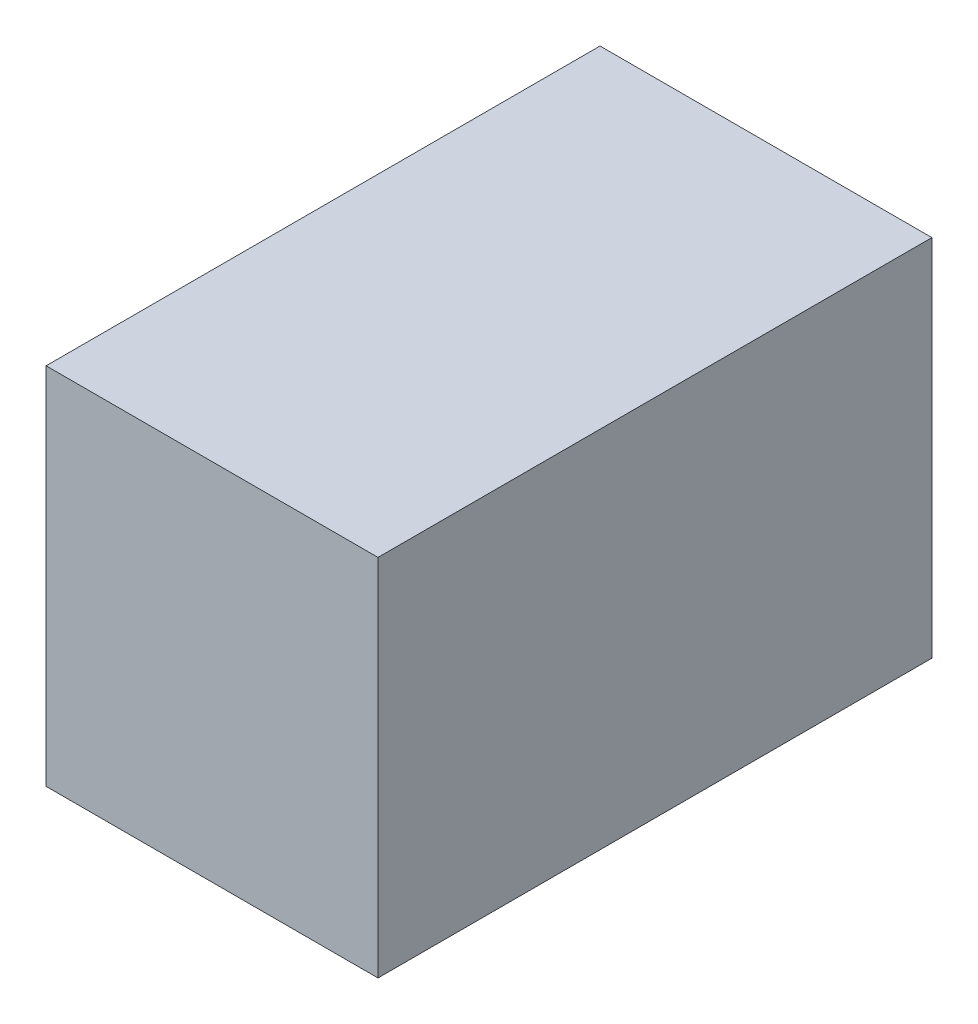
ISO-10303-21;
HEADER;
FILE_DESCRIPTION(('STEP AP214'),'2;1');
FILE_NAME('part.step','',(''),(''),'','','');
FILE_SCHEMA(('AUTOMOTIVE_DESIGN { 1 0 10303 214 1 1 1 1 }'));
ENDSEC;
DATA;
#1=APPLICATION_CONTEXT('core data for automotive mechanical design processes');
#2=APPLICATION_PROTOCOL_DEFINITION('international standard','automotive_design',2000,#1);
#3=PRODUCT_CONTEXT('',#1,'mechanical');
#4=PRODUCT('Part','Part','',(#3));
#5=PRODUCT_RELATED_PRODUCT_CATEGORY('part','',(#4));
#6=PRODUCT_DEFINITION_FORMATION('','',#4);
#7=PRODUCT_DEFINITION_CONTEXT('part definition',#1,'design');
#8=PRODUCT_DEFINITION('design','',#6,#7);
#9=PRODUCT_DEFINITION_SHAPE('','',#8);
#10=(LENGTH_UNIT() NAMED_UNIT(*) SI_UNIT(.MILLI.,.METRE.));
#11=(NAMED_UNIT(*) PLANE_ANGLE_UNIT() SI_UNIT($,.RADIAN.));
#12=(NAMED_UNIT(*) SI_UNIT($,.STERADIAN.) SOLID_ANGLE_UNIT());
#13=UNCERTAINTY_MEASURE_WITH_UNIT(LENGTH_MEASURE(1.E-05),#10,'distance_accuracy_value','');
#14=(GEOMETRIC_REPRESENTATION_CONTEXT(3) GLOBAL_UNCERTAINTY_ASSIGNED_CONTEXT((#13)) GLOBAL_UNIT_ASSIGNED_CONTEXT((#10,
#11,#12)) REPRESENTATION_CONTEXT('',''));
#15=CARTESIAN_POINT('',(0.,0.,0.));
#16=DIRECTION('',(0.,0.,1.));
#17=DIRECTION('',(1.,0.,0.));
#18=AXIS2_PLACEMENT_3D('',#15,#16,#17);
#19=CARTESIAN_POINT('',(19.,9.525,-17.525));
#20=DIRECTION('',(0.,0.,1.));
#21=DIRECTION('',(1.,0.,0.));
#22=AXIS2_PLACEMENT_3D('',#19,#20,#21);
#23=PLANE('',#22);
#24=DIRECTION('',(0.,-1.,0.));
#25=VECTOR('',#24,1.);
#26=CARTESIAN_POINT('',(12.,9.525,-17.525));
#27=LINE('',#26,#25);
#28=CARTESIAN_POINT('',(12.,9.525,-17.525));
#29=VERTEX_POINT('',#28);
#30=CARTESIAN_POINT('',(12.,-9.525,-17.525));
#31=VERTEX_POINT('',#30);
#32=EDGE_CURVE('E217',#29,#31,#27,.T.);
#33=ORIENTED_EDGE('',*,*,#32,.F.);
#34=DIRECTION('',(1.,0.,0.));
#35=VECTOR('',#34,1.);
#36=CARTESIAN_POINT('',(0.,9.525,-17.525));
#37=LINE('',#36,#35);
#38=CARTESIAN_POINT('',(0.,9.525,-17.525));
#39=VERTEX_POINT('',#38);
#40=EDGE_CURVE('E215',#39,#29,#37,.T.);
#41=ORIENTED_EDGE('',*,*,#40,.F.);
#42=DIRECTION('',(0.,1.,0.));
#43=VECTOR('',#42,1.);
#44=CARTESIAN_POINT('',(0.,9.525,-17.525));
#45=LINE('',#44,#43);
#46=CARTESIAN_POINT('',(0.,11.525,-17.525));
#47=VERTEX_POINT('',#46);
#48=EDGE_CURVE('E89',#39,#47,#45,.T.);
#49=ORIENTED_EDGE('',*,*,#48,.T.);
#50=DIRECTION('',(-1.,0.,0.));
#51=VECTOR('',#50,1.);
#52=CARTESIAN_POINT('',(19.,11.525,-17.525));
#53=LINE('',#52,#51);
#54=CARTESIAN_POINT('',(21.,11.525,-17.525));
#55=VERTEX_POINT('',#54);
#56=EDGE_CURVE('E11',#55,#47,#53,.T.);
#57=ORIENTED_EDGE('',*,*,#56,.F.);
#58=DIRECTION('',(0.,1.,0.));
#59=VECTOR('',#58,1.);
#60=CARTESIAN_POINT('',(21.,9.525,-17.525));
#61=LINE('',#60,#59);
#62=CARTESIAN_POINT('',(21.,-11.525,-17.525));
#63=VERTEX_POINT('',#62);
#64=EDGE_CURVE('E117',#63,#55,#61,.T.);
#65=ORIENTED_EDGE('',*,*,#64,.F.);
#66=DIRECTION('',(-1.,0.,0.));
#67=VECTOR('',#66,1.);
#68=CARTESIAN_POINT('',(19.,-11.525,-17.525));
#69=LINE('',#68,#67);
#70=CARTESIAN_POINT('',(0.,-11.525,-17.525));
#71=VERTEX_POINT('',#70);
#72=EDGE_CURVE('E129',#63,#71,#69,.T.);
#73=ORIENTED_EDGE('',*,*,#72,.T.);
#74=CARTESIAN_POINT('',(0.,-9.525,-17.525));
#75=VERTEX_POINT('',#74);
#76=EDGE_CURVE('E133',#71,#75,#45,.T.);
#77=ORIENTED_EDGE('',*,*,#76,.T.);
#78=DIRECTION('',(-1.,0.,0.));
#79=VECTOR('',#78,1.);
#80=CARTESIAN_POINT('',(12.,-9.525,-17.525));
#81=LINE('',#80,#79);
#82=EDGE_CURVE('E153',#31,#75,#81,.T.);
#83=ORIENTED_EDGE('',*,*,#82,.F.);
#84=EDGE_LOOP('',(#33,#41,#49,#57,#65,#73,#77,#83));
#85=FACE_BOUND('',#84,.T.);
#86=ADVANCED_FACE('F41',(#85),#23,.F.);
#87=CARTESIAN_POINT('',(19.,11.525,15.525));
#88=DIRECTION('',(0.,-1.,0.));
#89=DIRECTION('',(0.,0.,-1.));
#90=AXIS2_PLACEMENT_3D('',#87,#88,#89);
#91=PLANE('',#90);
#92=DIRECTION('',(0.,0.,1.));
#93=VECTOR('',#92,1.);
#94=CARTESIAN_POINT('',(0.,11.525,15.525));
#95=LINE('',#94,#93);
#96=CARTESIAN_POINT('',(0.,11.525,17.525));
#97=VERTEX_POINT('',#96);
#98=EDGE_CURVE('E45',#47,#97,#95,.T.);
#99=ORIENTED_EDGE('',*,*,#98,.T.);
#100=DIRECTION('',(-1.,0.,0.));
#101=VECTOR('',#100,1.);
#102=CARTESIAN_POINT('',(19.,11.525,17.525));
#103=LINE('',#102,#101);
#104=CARTESIAN_POINT('',(21.,11.525,17.525));
#105=VERTEX_POINT('',#104);
#106=EDGE_CURVE('E50',#105,#97,#103,.T.);
#107=ORIENTED_EDGE('',*,*,#106,.F.);
#108=DIRECTION('',(0.,0.,1.));
#109=VECTOR('',#108,1.);
#110=CARTESIAN_POINT('',(21.,11.525,15.525));
#111=LINE('',#110,#109);
#112=EDGE_CURVE('E111',#55,#105,#111,.T.);
#113=ORIENTED_EDGE('',*,*,#112,.F.);
#114=ORIENTED_EDGE('',*,*,#56,.T.);
#115=EDGE_LOOP('',(#99,#107,#113,#114));
#116=FACE_BOUND('',#115,.T.);
#117=ADVANCED_FACE('F121',(#116),#91,.F.);
#118=CARTESIAN_POINT('',(19.,9.525,17.525));
#119=DIRECTION('',(0.,0.,-1.));
#120=DIRECTION('',(0.,1.,0.));
#121=AXIS2_PLACEMENT_3D('',#118,#119,#120);
#122=PLANE('',#121);
#123=DIRECTION('',(0.,-1.,0.));
#124=VECTOR('',#123,1.);
#125=CARTESIAN_POINT('',(0.,9.525,17.525));
#126=LINE('',#125,#124);
#127=CARTESIAN_POINT('',(0.,-11.525,17.525));
#128=VERTEX_POINT('',#127);
#129=EDGE_CURVE('E137',#97,#128,#126,.T.);
#130=ORIENTED_EDGE('',*,*,#129,.T.);
#131=DIRECTION('',(-1.,0.,0.));
#132=VECTOR('',#131,1.);
#133=CARTESIAN_POINT('',(19.,-11.525,17.525));
#134=LINE('',#133,#132);
#135=CARTESIAN_POINT('',(21.,-11.525,17.525));
#136=VERTEX_POINT('',#135);
#137=EDGE_CURVE('E124',#136,#128,#134,.T.);
#138=ORIENTED_EDGE('',*,*,#137,.F.);
#139=DIRECTION('',(0.,-1.,0.));
#140=VECTOR('',#139,1.);
#141=CARTESIAN_POINT('',(21.,9.525,17.525));
#142=LINE('',#141,#140);
#143=EDGE_CURVE('E114',#105,#136,#142,.T.);
#144=ORIENTED_EDGE('',*,*,#143,.F.);
#145=ORIENTED_EDGE('',*,*,#106,.T.);
#146=EDGE_LOOP('',(#130,#138,#144,#145));
#147=FACE_BOUND('',#146,.T.);
#148=ADVANCED_FACE('F126',(#147),#122,.F.);
#149=CARTESIAN_POINT('',(19.,-11.525,15.525));
#150=DIRECTION('',(0.,1.,0.));
#151=DIRECTION('',(0.,0.,1.));
#152=AXIS2_PLACEMENT_3D('',#149,#150,#151);
#153=PLANE('',#152);
#154=DIRECTION('',(0.,0.,-1.));
#155=VECTOR('',#154,1.);
#156=CARTESIAN_POINT('',(0.,-11.525,15.525));
#157=LINE('',#156,#155);
#158=EDGE_CURVE('E136',#128,#71,#157,.T.);
#159=ORIENTED_EDGE('',*,*,#158,.T.);
#160=ORIENTED_EDGE('',*,*,#72,.F.);
#161=DIRECTION('',(0.,0.,-1.));
#162=VECTOR('',#161,1.);
#163=CARTESIAN_POINT('',(21.,-11.525,15.525));
#164=LINE('',#163,#162);
#165=EDGE_CURVE('E67',#136,#63,#164,.T.);
#166=ORIENTED_EDGE('',*,*,#165,.F.);
#167=ORIENTED_EDGE('',*,*,#137,.T.);
#168=EDGE_LOOP('',(#159,#160,#166,#167));
#169=FACE_BOUND('',#168,.T.);
#170=ADVANCED_FACE('F141',(#169),#153,.F.);
#171=CARTESIAN_POINT('',(21.,0.,0.));
#172=DIRECTION('',(1.,0.,0.));
#173=DIRECTION('',(0.,0.,-1.));
#174=AXIS2_PLACEMENT_3D('',#171,#172,#173);
#175=PLANE('',#174);
#176=ORIENTED_EDGE('',*,*,#64,.T.);
#177=ORIENTED_EDGE('',*,*,#112,.T.);
#178=ORIENTED_EDGE('',*,*,#143,.T.);
#179=ORIENTED_EDGE('',*,*,#165,.T.);
#180=EDGE_LOOP('',(#176,#177,#178,#179));
#181=FACE_BOUND('',#180,.T.);
#182=ADVANCED_FACE('F43',(#181),#175,.T.);
#183=CARTESIAN_POINT('',(0.,0.,0.));
#184=DIRECTION('',(1.,0.,0.));
#185=DIRECTION('',(0.,0.,-1.));
#186=AXIS2_PLACEMENT_3D('',#183,#184,#185);
#187=PLANE('',#186);
#188=ORIENTED_EDGE('',*,*,#48,.F.);
#189=DIRECTION('',(0.,0.,1.));
#190=VECTOR('',#189,1.);
#191=CARTESIAN_POINT('',(0.,9.525,15.525));
#192=LINE('',#191,#190);
#193=CARTESIAN_POINT('',(0.,9.525,15.525));
#194=VERTEX_POINT('',#193);
#195=EDGE_CURVE('E195',#39,#194,#192,.T.);
#196=ORIENTED_EDGE('',*,*,#195,.T.);
#197=DIRECTION('',(0.,-1.,0.));
#198=VECTOR('',#197,1.);
#199=CARTESIAN_POINT('',(0.,9.525,15.525));
#200=LINE('',#199,#198);
#201=CARTESIAN_POINT('',(0.,-9.525,15.525));
#202=VERTEX_POINT('',#201);
#203=EDGE_CURVE('E58',#194,#202,#200,.T.);
#204=ORIENTED_EDGE('',*,*,#203,.T.);
#205=DIRECTION('',(0.,0.,-1.));
#206=VECTOR('',#205,1.);
#207=CARTESIAN_POINT('',(0.,-9.525,15.525));
#208=LINE('',#207,#206);
#209=EDGE_CURVE('E148',#202,#75,#208,.T.);
#210=ORIENTED_EDGE('',*,*,#209,.T.);
#211=ORIENTED_EDGE('',*,*,#76,.F.);
#212=ORIENTED_EDGE('',*,*,#158,.F.);
#213=ORIENTED_EDGE('',*,*,#129,.F.);
#214=ORIENTED_EDGE('',*,*,#98,.F.);
#215=EDGE_LOOP('',(#188,#196,#204,#210,#211,#212,#213,#214));
#216=FACE_BOUND('',#215,.T.);
#217=ADVANCED_FACE('F144',(#216),#187,.F.);
#218=CARTESIAN_POINT('',(19.,9.525,-15.525));
#219=DIRECTION('',(0.,0.,1.));
#220=DIRECTION('',(1.,0.,0.));
#221=AXIS2_PLACEMENT_3D('',#218,#219,#220);
#222=PLANE('',#221);
#223=DIRECTION('',(0.,-1.,0.));
#224=VECTOR('',#223,1.);
#225=CARTESIAN_POINT('',(12.,9.525,-15.525));
#226=LINE('',#225,#224);
#227=CARTESIAN_POINT('',(12.,9.525,-15.525));
#228=VERTEX_POINT('',#227);
#229=CARTESIAN_POINT('',(12.,-9.525,-15.525));
#230=VERTEX_POINT('',#229);
#231=EDGE_CURVE('E208',#228,#230,#226,.T.);
#232=ORIENTED_EDGE('',*,*,#231,.T.);
#233=DIRECTION('',(-1.,0.,0.));
#234=VECTOR('',#233,1.);
#235=CARTESIAN_POINT('',(19.,-9.525,-15.525));
#236=LINE('',#235,#234);
#237=CARTESIAN_POINT('',(19.,-9.525,-15.525));
#238=VERTEX_POINT('',#237);
#239=EDGE_CURVE('E191',#238,#230,#236,.T.);
#240=ORIENTED_EDGE('',*,*,#239,.F.);
#241=DIRECTION('',(0.,1.,0.));
#242=VECTOR('',#241,1.);
#243=CARTESIAN_POINT('',(19.,9.525,-15.525));
#244=LINE('',#243,#242);
#245=CARTESIAN_POINT('',(19.,9.525,-15.525));
#246=VERTEX_POINT('',#245);
#247=EDGE_CURVE('E184',#238,#246,#244,.T.);
#248=ORIENTED_EDGE('',*,*,#247,.T.);
#249=DIRECTION('',(-1.,0.,0.));
#250=VECTOR('',#249,1.);
#251=CARTESIAN_POINT('',(19.,9.525,-15.525));
#252=LINE('',#251,#250);
#253=EDGE_CURVE('E178',#246,#228,#252,.T.);
#254=ORIENTED_EDGE('',*,*,#253,.T.);
#255=EDGE_LOOP('',(#232,#240,#248,#254));
#256=FACE_BOUND('',#255,.T.);
#257=ADVANCED_FACE('F206',(#256),#222,.T.);
#258=CARTESIAN_POINT('',(19.,9.525,15.525));
#259=DIRECTION('',(0.,-1.,0.));
#260=DIRECTION('',(0.,0.,-1.));
#261=AXIS2_PLACEMENT_3D('',#258,#259,#260);
#262=PLANE('',#261);
#263=ORIENTED_EDGE('',*,*,#195,.F.);
#264=ORIENTED_EDGE('',*,*,#40,.T.);
#265=DIRECTION('',(0.,0.,-1.));
#266=VECTOR('',#265,1.);
#267=CARTESIAN_POINT('',(12.,9.525,6.98949533078635));
#268=LINE('',#267,#266);
#269=EDGE_CURVE('E212',#228,#29,#268,.T.);
#270=ORIENTED_EDGE('',*,*,#269,.F.);
#271=ORIENTED_EDGE('',*,*,#253,.F.);
#272=DIRECTION('',(0.,0.,1.));
#273=VECTOR('',#272,1.);
#274=CARTESIAN_POINT('',(19.,9.525,15.525));
#275=LINE('',#274,#273);
#276=CARTESIAN_POINT('',(19.,9.525,15.525));
#277=VERTEX_POINT('',#276);
#278=EDGE_CURVE('E172',#246,#277,#275,.T.);
#279=ORIENTED_EDGE('',*,*,#278,.T.);
#280=DIRECTION('',(-1.,0.,0.));
#281=VECTOR('',#280,1.);
#282=CARTESIAN_POINT('',(19.,9.525,15.525));
#283=LINE('',#282,#281);
#284=EDGE_CURVE('E174',#277,#194,#283,.T.);
#285=ORIENTED_EDGE('',*,*,#284,.T.);
#286=EDGE_LOOP('',(#263,#264,#270,#271,#279,#285));
#287=FACE_BOUND('',#286,.T.);
#288=ADVANCED_FACE('F173',(#287),#262,.T.);
#289=CARTESIAN_POINT('',(19.,9.525,15.525));
#290=DIRECTION('',(0.,0.,-1.));
#291=DIRECTION('',(0.,1.,0.));
#292=AXIS2_PLACEMENT_3D('',#289,#290,#291);
#293=PLANE('',#292);
#294=ORIENTED_EDGE('',*,*,#203,.F.);
#295=ORIENTED_EDGE('',*,*,#284,.F.);
#296=DIRECTION('',(0.,-1.,0.));
#297=VECTOR('',#296,1.);
#298=CARTESIAN_POINT('',(19.,9.525,15.525));
#299=LINE('',#298,#297);
#300=CARTESIAN_POINT('',(19.,-9.525,15.525));
#301=VERTEX_POINT('',#300);
#302=EDGE_CURVE('E183',#277,#301,#299,.T.);
#303=ORIENTED_EDGE('',*,*,#302,.T.);
#304=DIRECTION('',(-1.,0.,0.));
#305=VECTOR('',#304,1.);
#306=CARTESIAN_POINT('',(19.,-9.525,15.525));
#307=LINE('',#306,#305);
#308=EDGE_CURVE('E187',#301,#202,#307,.T.);
#309=ORIENTED_EDGE('',*,*,#308,.T.);
#310=EDGE_LOOP('',(#294,#295,#303,#309));
#311=FACE_BOUND('',#310,.T.);
#312=ADVANCED_FACE('F186',(#311),#293,.T.);
#313=CARTESIAN_POINT('',(19.,-9.525,15.525));
#314=DIRECTION('',(0.,1.,0.));
#315=DIRECTION('',(0.,0.,1.));
#316=AXIS2_PLACEMENT_3D('',#313,#314,#315);
#317=PLANE('',#316);
#318=ORIENTED_EDGE('',*,*,#209,.F.);
#319=ORIENTED_EDGE('',*,*,#308,.F.);
#320=DIRECTION('',(0.,0.,-1.));
#321=VECTOR('',#320,1.);
#322=CARTESIAN_POINT('',(19.,-9.525,15.525));
#323=LINE('',#322,#321);
#324=EDGE_CURVE('E98',#301,#238,#323,.T.);
#325=ORIENTED_EDGE('',*,*,#324,.T.);
#326=ORIENTED_EDGE('',*,*,#239,.T.);
#327=DIRECTION('',(0.,0.,-1.));
#328=VECTOR('',#327,1.);
#329=CARTESIAN_POINT('',(12.,-9.525,6.98949533078635));
#330=LINE('',#329,#328);
#331=EDGE_CURVE('E197',#230,#31,#330,.T.);
#332=ORIENTED_EDGE('',*,*,#331,.T.);
#333=ORIENTED_EDGE('',*,*,#82,.T.);
#334=EDGE_LOOP('',(#318,#319,#325,#326,#332,#333));
#335=FACE_BOUND('',#334,.T.);
#336=ADVANCED_FACE('F222',(#335),#317,.T.);
#337=CARTESIAN_POINT('',(19.,0.,0.));
#338=DIRECTION('',(1.,0.,0.));
#339=DIRECTION('',(0.,0.,-1.));
#340=AXIS2_PLACEMENT_3D('',#337,#338,#339);
#341=PLANE('',#340);
#342=ORIENTED_EDGE('',*,*,#247,.F.);
#343=ORIENTED_EDGE('',*,*,#324,.F.);
#344=ORIENTED_EDGE('',*,*,#302,.F.);
#345=ORIENTED_EDGE('',*,*,#278,.F.);
#346=EDGE_LOOP('',(#342,#343,#344,#345));
#347=FACE_BOUND('',#346,.T.);
#348=ADVANCED_FACE('F189',(#347),#341,.F.);
#349=CARTESIAN_POINT('',(12.,9.525,6.98949533078635));
#350=DIRECTION('',(1.,0.,0.));
#351=DIRECTION('',(0.,1.,0.));
#352=AXIS2_PLACEMENT_3D('',#349,#350,#351);
#353=PLANE('',#352);
#354=ORIENTED_EDGE('',*,*,#269,.T.);
#355=ORIENTED_EDGE('',*,*,#32,.T.);
#356=ORIENTED_EDGE('',*,*,#331,.F.);
#357=ORIENTED_EDGE('',*,*,#231,.F.);
#358=EDGE_LOOP('',(#354,#355,#356,#357));
#359=FACE_BOUND('',#358,.T.);
#360=ADVANCED_FACE('F210',(#359),#353,.F.);
#361=CLOSED_SHELL('',(#86,#117,#148,#170,#182,#217,#257,#288,#312,#336,#348,#360));
#362=MANIFOLD_SOLID_BREP('B2',#361);
#363=ADVANCED_BREP_SHAPE_REPRESENTATION('',(#18,#362),#14);
#364=SHAPE_DEFINITION_REPRESENTATION(#9,#363);
ENDSEC;
END-ISO-10303-21;
